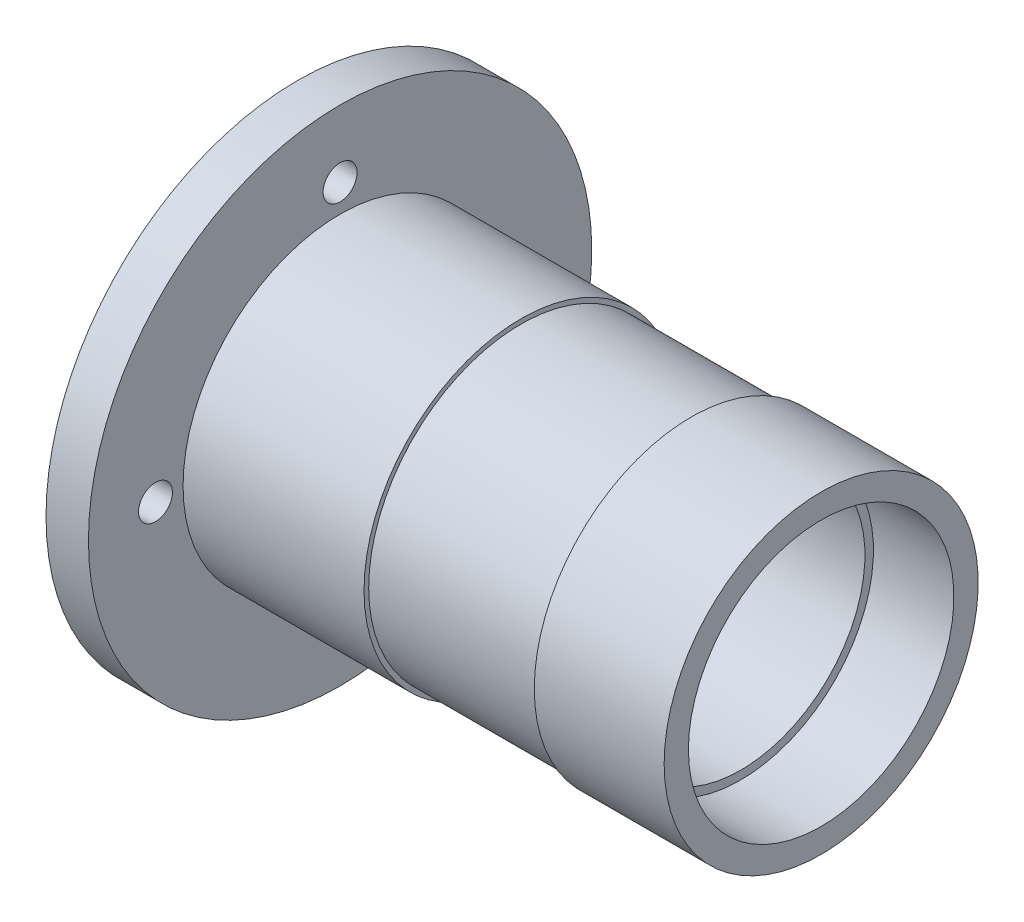
ISO-10303-21;
HEADER;
FILE_DESCRIPTION(('STEP AP214'),'2;1');
FILE_NAME('part.step','',(''),(''),'','','');
FILE_SCHEMA(('AUTOMOTIVE_DESIGN { 1 0 10303 214 1 1 1 1 }'));
ENDSEC;
DATA;
#1=APPLICATION_CONTEXT('core data for automotive mechanical design processes');
#2=APPLICATION_PROTOCOL_DEFINITION('international standard','automotive_design',2000,#1);
#3=PRODUCT_CONTEXT('',#1,'mechanical');
#4=PRODUCT('Part','Part','',(#3));
#5=PRODUCT_RELATED_PRODUCT_CATEGORY('part','',(#4));
#6=PRODUCT_DEFINITION_FORMATION('','',#4);
#7=PRODUCT_DEFINITION_CONTEXT('part definition',#1,'design');
#8=PRODUCT_DEFINITION('design','',#6,#7);
#9=PRODUCT_DEFINITION_SHAPE('','',#8);
#10=(LENGTH_UNIT() NAMED_UNIT(*) SI_UNIT(.MILLI.,.METRE.));
#11=(NAMED_UNIT(*) PLANE_ANGLE_UNIT() SI_UNIT($,.RADIAN.));
#12=(NAMED_UNIT(*) SI_UNIT($,.STERADIAN.) SOLID_ANGLE_UNIT());
#13=UNCERTAINTY_MEASURE_WITH_UNIT(LENGTH_MEASURE(1.E-05),#10,'distance_accuracy_value','');
#14=(GEOMETRIC_REPRESENTATION_CONTEXT(3) GLOBAL_UNCERTAINTY_ASSIGNED_CONTEXT((#13)) GLOBAL_UNIT_ASSIGNED_CONTEXT((#10,
#11,#12)) REPRESENTATION_CONTEXT('',''));
#15=CARTESIAN_POINT('',(0.,0.,0.));
#16=DIRECTION('',(0.,0.,1.));
#17=DIRECTION('',(1.,0.,0.));
#18=AXIS2_PLACEMENT_3D('',#15,#16,#17);
#19=CARTESIAN_POINT('',(73.2980507434922,31.28,0.));
#20=DIRECTION('',(-1.,0.,0.));
#21=DIRECTION('',(0.,0.,1.));
#22=AXIS2_PLACEMENT_3D('',#19,#20,#21);
#23=PLANE('',#22);
#24=CARTESIAN_POINT('',(73.2980507434922,0.,0.));
#25=DIRECTION('',(-1.,0.,0.));
#26=DIRECTION('',(0.,0.,1.));
#27=AXIS2_PLACEMENT_3D('',#24,#25,#26);
#28=CIRCLE('',#27,37.);
#29=CARTESIAN_POINT('',(73.2980507434922,0.,37.));
#30=VERTEX_POINT('',#29);
#31=EDGE_CURVE('E11',#30,#30,#28,.T.);
#32=ORIENTED_EDGE('',*,*,#31,.F.);
#33=EDGE_LOOP('',(#32));
#34=FACE_BOUND('',#33,.T.);
#35=CARTESIAN_POINT('',(73.2980507434922,0.,0.));
#36=DIRECTION('',(-1.,0.,0.));
#37=DIRECTION('',(0.,0.,1.));
#38=AXIS2_PLACEMENT_3D('',#35,#36,#37);
#39=CIRCLE('',#38,31.28);
#40=CARTESIAN_POINT('',(73.2980507434922,0.,31.28));
#41=VERTEX_POINT('',#40);
#42=EDGE_CURVE('E84',#41,#41,#39,.T.);
#43=ORIENTED_EDGE('',*,*,#42,.T.);
#44=EDGE_LOOP('',(#43));
#45=FACE_BOUND('',#44,.T.);
#46=ADVANCED_FACE('F38',(#34,#45),#23,.F.);
#47=CARTESIAN_POINT('',(-67.0431894929216,0.,0.));
#48=DIRECTION('',(-1.,0.,0.));
#49=DIRECTION('',(0.,0.,1.));
#50=AXIS2_PLACEMENT_3D('',#47,#48,#49);
#51=CYLINDRICAL_SURFACE('',#50,37.);
#52=CARTESIAN_POINT('',(42.6980507434922,0.,0.));
#53=DIRECTION('',(-1.,0.,0.));
#54=DIRECTION('',(0.,0.,1.));
#55=AXIS2_PLACEMENT_3D('',#52,#53,#54);
#56=CIRCLE('',#55,37.);
#57=CARTESIAN_POINT('',(42.6980507434922,0.,37.));
#58=VERTEX_POINT('',#57);
#59=EDGE_CURVE('E44',#58,#58,#56,.T.);
#60=ORIENTED_EDGE('',*,*,#59,.F.);
#61=EDGE_LOOP('',(#60));
#62=FACE_BOUND('',#61,.T.);
#63=ORIENTED_EDGE('',*,*,#31,.T.);
#64=EDGE_LOOP('',(#63));
#65=FACE_BOUND('',#64,.T.);
#66=ADVANCED_FACE('F163',(#62,#65),#51,.T.);
#67=CARTESIAN_POINT('',(42.6980507434922,37.,0.));
#68=DIRECTION('',(1.,0.,0.));
#69=DIRECTION('',(0.,0.,-1.));
#70=AXIS2_PLACEMENT_3D('',#67,#68,#69);
#71=PLANE('',#70);
#72=CARTESIAN_POINT('',(42.6980507434922,0.,0.));
#73=DIRECTION('',(-1.,0.,0.));
#74=DIRECTION('',(0.,0.,1.));
#75=AXIS2_PLACEMENT_3D('',#72,#73,#74);
#76=CIRCLE('',#75,35.9);
#77=CARTESIAN_POINT('',(42.6980507434922,0.,35.9));
#78=VERTEX_POINT('',#77);
#79=EDGE_CURVE('E48',#78,#78,#76,.T.);
#80=ORIENTED_EDGE('',*,*,#79,.F.);
#81=EDGE_LOOP('',(#80));
#82=FACE_BOUND('',#81,.T.);
#83=ORIENTED_EDGE('',*,*,#59,.T.);
#84=EDGE_LOOP('',(#83));
#85=FACE_BOUND('',#84,.T.);
#86=ADVANCED_FACE('F158',(#82,#85),#71,.F.);
#87=CARTESIAN_POINT('',(-67.0431894929216,0.,0.));
#88=DIRECTION('',(-1.,0.,0.));
#89=DIRECTION('',(0.,0.,1.));
#90=AXIS2_PLACEMENT_3D('',#87,#88,#89);
#91=CYLINDRICAL_SURFACE('',#90,35.9);
#92=CARTESIAN_POINT('',(2.57805074349222,0.,0.));
#93=DIRECTION('',(-1.,0.,0.));
#94=DIRECTION('',(0.,0.,1.));
#95=AXIS2_PLACEMENT_3D('',#92,#93,#94);
#96=CIRCLE('',#95,35.9);
#97=CARTESIAN_POINT('',(2.57805074349222,0.,35.9));
#98=VERTEX_POINT('',#97);
#99=EDGE_CURVE('E52',#98,#98,#96,.T.);
#100=ORIENTED_EDGE('',*,*,#99,.F.);
#101=EDGE_LOOP('',(#100));
#102=FACE_BOUND('',#101,.T.);
#103=ORIENTED_EDGE('',*,*,#79,.T.);
#104=EDGE_LOOP('',(#103));
#105=FACE_BOUND('',#104,.T.);
#106=ADVANCED_FACE('F152',(#102,#105),#91,.T.);
#107=CARTESIAN_POINT('',(2.57805074349223,35.9,0.));
#108=DIRECTION('',(-1.,0.,0.));
#109=DIRECTION('',(0.,0.,1.));
#110=AXIS2_PLACEMENT_3D('',#107,#108,#109);
#111=PLANE('',#110);
#112=CARTESIAN_POINT('',(2.57805074349222,0.,0.));
#113=DIRECTION('',(-1.,0.,0.));
#114=DIRECTION('',(0.,0.,1.));
#115=AXIS2_PLACEMENT_3D('',#112,#113,#114);
#116=CIRCLE('',#115,37.);
#117=CARTESIAN_POINT('',(2.57805074349222,0.,37.));
#118=VERTEX_POINT('',#117);
#119=EDGE_CURVE('E57',#118,#118,#116,.T.);
#120=ORIENTED_EDGE('',*,*,#119,.F.);
#121=EDGE_LOOP('',(#120));
#122=FACE_BOUND('',#121,.T.);
#123=ORIENTED_EDGE('',*,*,#99,.T.);
#124=EDGE_LOOP('',(#123));
#125=FACE_BOUND('',#124,.T.);
#126=ADVANCED_FACE('F146',(#122,#125),#111,.F.);
#127=CARTESIAN_POINT('',(-67.0431894929216,0.,0.));
#128=DIRECTION('',(-1.,0.,0.));
#129=DIRECTION('',(0.,0.,1.));
#130=AXIS2_PLACEMENT_3D('',#127,#128,#129);
#131=CYLINDRICAL_SURFACE('',#130,37.);
#132=CARTESIAN_POINT('',(-40.0619492565078,0.,0.));
#133=DIRECTION('',(-1.,0.,0.));
#134=DIRECTION('',(0.,0.,1.));
#135=AXIS2_PLACEMENT_3D('',#132,#133,#134);
#136=CIRCLE('',#135,37.);
#137=CARTESIAN_POINT('',(-40.0619492565078,0.,37.));
#138=VERTEX_POINT('',#137);
#139=EDGE_CURVE('E60',#138,#138,#136,.T.);
#140=ORIENTED_EDGE('',*,*,#139,.F.);
#141=EDGE_LOOP('',(#140));
#142=FACE_BOUND('',#141,.T.);
#143=ORIENTED_EDGE('',*,*,#119,.T.);
#144=EDGE_LOOP('',(#143));
#145=FACE_BOUND('',#144,.T.);
#146=ADVANCED_FACE('F139',(#142,#145),#131,.T.);
#147=CARTESIAN_POINT('',(-40.0619492565078,37.,0.));
#148=DIRECTION('',(-1.,0.,0.));
#149=DIRECTION('',(0.,0.,1.));
#150=AXIS2_PLACEMENT_3D('',#147,#148,#149);
#151=PLANE('',#150);
#152=CARTESIAN_POINT('',(-40.0619492565078,-6.07518016864451E-13,-43.4999999999994));
#153=DIRECTION('',(-1.,0.,0.));
#154=DIRECTION('',(0.,0.,1.));
#155=AXIS2_PLACEMENT_3D('',#152,#153,#154);
#156=CIRCLE('',#155,4.0000000000012);
#157=CARTESIAN_POINT('',(-40.0619492565078,-6.07518016864451E-13,-39.4999999999982));
#158=VERTEX_POINT('',#157);
#159=EDGE_CURVE('E105',#158,#158,#156,.T.);
#160=ORIENTED_EDGE('',*,*,#159,.T.);
#161=EDGE_LOOP('',(#160));
#162=FACE_BOUND('',#161,.T.);
#163=CARTESIAN_POINT('',(-40.0619492565078,-1.51879526208258E-13,43.5));
#164=DIRECTION('',(-1.,0.,0.));
#165=DIRECTION('',(0.,0.,1.));
#166=AXIS2_PLACEMENT_3D('',#163,#164,#165);
#167=CIRCLE('',#166,4.);
#168=CARTESIAN_POINT('',(-40.0619492565078,-1.51879526208258E-13,47.5));
#169=VERTEX_POINT('',#168);
#170=EDGE_CURVE('E99',#169,#169,#167,.T.);
#171=ORIENTED_EDGE('',*,*,#170,.T.);
#172=EDGE_LOOP('',(#171));
#173=FACE_BOUND('',#172,.T.);
#174=CARTESIAN_POINT('',(-40.0619492565078,-43.5,1.22569046088148E-12));
#175=DIRECTION('',(-1.,0.,0.));
#176=DIRECTION('',(0.,0.,1.));
#177=AXIS2_PLACEMENT_3D('',#174,#175,#176);
#178=CIRCLE('',#177,4.00000000000146);
#179=CARTESIAN_POINT('',(-40.0619492565078,-43.5,4.00000000000269));
#180=VERTEX_POINT('',#179);
#181=EDGE_CURVE('E93',#180,#180,#178,.T.);
#182=ORIENTED_EDGE('',*,*,#181,.T.);
#183=EDGE_LOOP('',(#182));
#184=FACE_BOUND('',#183,.T.);
#185=CARTESIAN_POINT('',(-40.0619492565078,43.5,0.));
#186=DIRECTION('',(-1.,0.,0.));
#187=DIRECTION('',(0.,0.,1.));
#188=AXIS2_PLACEMENT_3D('',#185,#186,#187);
#189=CIRCLE('',#188,4.);
#190=CARTESIAN_POINT('',(-40.0619492565078,43.5,4.));
#191=VERTEX_POINT('',#190);
#192=EDGE_CURVE('E87',#191,#191,#189,.T.);
#193=ORIENTED_EDGE('',*,*,#192,.T.);
#194=EDGE_LOOP('',(#193));
#195=FACE_BOUND('',#194,.T.);
#196=CARTESIAN_POINT('',(-40.0619492565078,0.,0.));
#197=DIRECTION('',(-1.,0.,0.));
#198=DIRECTION('',(0.,0.,1.));
#199=AXIS2_PLACEMENT_3D('',#196,#197,#198);
#200=CIRCLE('',#199,59.300299500832);
#201=CARTESIAN_POINT('',(-40.0619492565078,0.,59.300299500832));
#202=VERTEX_POINT('',#201);
#203=EDGE_CURVE('E63',#202,#202,#200,.T.);
#204=ORIENTED_EDGE('',*,*,#203,.F.);
#205=EDGE_LOOP('',(#204));
#206=FACE_BOUND('',#205,.T.);
#207=ORIENTED_EDGE('',*,*,#139,.T.);
#208=EDGE_LOOP('',(#207));
#209=FACE_BOUND('',#208,.T.);
#210=ADVANCED_FACE('F133',(#162,#173,#184,#195,#206,#209),#151,.F.);
#211=CARTESIAN_POINT('',(-67.0431894929216,0.,0.));
#212=DIRECTION('',(-1.,0.,0.));
#213=DIRECTION('',(0.,0.,1.));
#214=AXIS2_PLACEMENT_3D('',#211,#212,#213);
#215=CYLINDRICAL_SURFACE('',#214,59.300299500832);
#216=CARTESIAN_POINT('',(-50.0619492565078,0.,0.));
#217=DIRECTION('',(-1.,0.,0.));
#218=DIRECTION('',(0.,0.,1.));
#219=AXIS2_PLACEMENT_3D('',#216,#217,#218);
#220=CIRCLE('',#219,59.300299500832);
#221=CARTESIAN_POINT('',(-50.0619492565078,0.,59.300299500832));
#222=VERTEX_POINT('',#221);
#223=EDGE_CURVE('E66',#222,#222,#220,.T.);
#224=ORIENTED_EDGE('',*,*,#223,.F.);
#225=EDGE_LOOP('',(#224));
#226=FACE_BOUND('',#225,.T.);
#227=ORIENTED_EDGE('',*,*,#203,.T.);
#228=EDGE_LOOP('',(#227));
#229=FACE_BOUND('',#228,.T.);
#230=ADVANCED_FACE('F119',(#226,#229),#215,.T.);
#231=CARTESIAN_POINT('',(-50.0619492565078,59.300299500832,0.));
#232=DIRECTION('',(1.,0.,0.));
#233=DIRECTION('',(0.,0.,-1.));
#234=AXIS2_PLACEMENT_3D('',#231,#232,#233);
#235=PLANE('',#234);
#236=CARTESIAN_POINT('',(-50.0619492565078,-6.07518016864451E-13,-43.4999999999994));
#237=DIRECTION('',(-1.,0.,0.));
#238=DIRECTION('',(0.,0.,1.));
#239=AXIS2_PLACEMENT_3D('',#236,#237,#238);
#240=CIRCLE('',#239,4.0000000000012);
#241=CARTESIAN_POINT('',(-50.0619492565078,-6.07518016864451E-13,-39.4999999999982));
#242=VERTEX_POINT('',#241);
#243=EDGE_CURVE('E108',#242,#242,#240,.T.);
#244=ORIENTED_EDGE('',*,*,#243,.F.);
#245=EDGE_LOOP('',(#244));
#246=FACE_BOUND('',#245,.T.);
#247=CARTESIAN_POINT('',(-50.0619492565078,-1.51879526208258E-13,43.5));
#248=DIRECTION('',(-1.,0.,0.));
#249=DIRECTION('',(0.,0.,1.));
#250=AXIS2_PLACEMENT_3D('',#247,#248,#249);
#251=CIRCLE('',#250,4.);
#252=CARTESIAN_POINT('',(-50.0619492565078,-1.51879526208258E-13,47.5));
#253=VERTEX_POINT('',#252);
#254=EDGE_CURVE('E102',#253,#253,#251,.T.);
#255=ORIENTED_EDGE('',*,*,#254,.F.);
#256=EDGE_LOOP('',(#255));
#257=FACE_BOUND('',#256,.T.);
#258=CARTESIAN_POINT('',(-50.0619492565078,-43.5,1.22569046088148E-12));
#259=DIRECTION('',(-1.,0.,0.));
#260=DIRECTION('',(0.,0.,1.));
#261=AXIS2_PLACEMENT_3D('',#258,#259,#260);
#262=CIRCLE('',#261,4.00000000000146);
#263=CARTESIAN_POINT('',(-50.0619492565078,-43.5,4.00000000000269));
#264=VERTEX_POINT('',#263);
#265=EDGE_CURVE('E96',#264,#264,#262,.T.);
#266=ORIENTED_EDGE('',*,*,#265,.F.);
#267=EDGE_LOOP('',(#266));
#268=FACE_BOUND('',#267,.T.);
#269=CARTESIAN_POINT('',(-50.0619492565078,43.5,0.));
#270=DIRECTION('',(-1.,0.,0.));
#271=DIRECTION('',(0.,0.,1.));
#272=AXIS2_PLACEMENT_3D('',#269,#270,#271);
#273=CIRCLE('',#272,4.);
#274=CARTESIAN_POINT('',(-50.0619492565078,43.5,4.));
#275=VERTEX_POINT('',#274);
#276=EDGE_CURVE('E90',#275,#275,#273,.T.);
#277=ORIENTED_EDGE('',*,*,#276,.F.);
#278=EDGE_LOOP('',(#277));
#279=FACE_BOUND('',#278,.T.);
#280=CARTESIAN_POINT('',(-50.0619492565078,0.,0.));
#281=DIRECTION('',(-1.,0.,0.));
#282=DIRECTION('',(0.,0.,1.));
#283=AXIS2_PLACEMENT_3D('',#280,#281,#282);
#284=CIRCLE('',#283,31.28);
#285=CARTESIAN_POINT('',(-50.0619492565078,0.,31.28));
#286=VERTEX_POINT('',#285);
#287=EDGE_CURVE('E69',#286,#286,#284,.T.);
#288=ORIENTED_EDGE('',*,*,#287,.F.);
#289=EDGE_LOOP('',(#288));
#290=FACE_BOUND('',#289,.T.);
#291=ORIENTED_EDGE('',*,*,#223,.T.);
#292=EDGE_LOOP('',(#291));
#293=FACE_BOUND('',#292,.T.);
#294=ADVANCED_FACE('F115',(#246,#257,#268,#279,#290,#293),#235,.F.);
#295=CARTESIAN_POINT('',(-67.0431894929216,0.,0.));
#296=DIRECTION('',(-1.,0.,0.));
#297=DIRECTION('',(0.,0.,1.));
#298=AXIS2_PLACEMENT_3D('',#295,#296,#297);
#299=CYLINDRICAL_SURFACE('',#298,31.28);
#300=CARTESIAN_POINT('',(-9.06194925650777,0.,0.));
#301=DIRECTION('',(-1.,0.,0.));
#302=DIRECTION('',(0.,0.,1.));
#303=AXIS2_PLACEMENT_3D('',#300,#301,#302);
#304=CIRCLE('',#303,31.28);
#305=CARTESIAN_POINT('',(-9.06194925650777,0.,31.28));
#306=VERTEX_POINT('',#305);
#307=EDGE_CURVE('E72',#306,#306,#304,.T.);
#308=ORIENTED_EDGE('',*,*,#307,.F.);
#309=EDGE_LOOP('',(#308));
#310=FACE_BOUND('',#309,.T.);
#311=ORIENTED_EDGE('',*,*,#287,.T.);
#312=EDGE_LOOP('',(#311));
#313=FACE_BOUND('',#312,.T.);
#314=ADVANCED_FACE('F118',(#310,#313),#299,.F.);
#315=CARTESIAN_POINT('',(-9.06194925650777,31.28,0.));
#316=DIRECTION('',(1.,0.,0.));
#317=DIRECTION('',(0.,0.,-1.));
#318=AXIS2_PLACEMENT_3D('',#315,#316,#317);
#319=PLANE('',#318);
#320=CARTESIAN_POINT('',(-9.06194925650777,0.,0.));
#321=DIRECTION('',(-1.,0.,0.));
#322=DIRECTION('',(0.,0.,1.));
#323=AXIS2_PLACEMENT_3D('',#320,#321,#322);
#324=CIRCLE('',#323,29.28);
#325=CARTESIAN_POINT('',(-9.06194925650777,0.,29.28));
#326=VERTEX_POINT('',#325);
#327=EDGE_CURVE('E75',#326,#326,#324,.T.);
#328=ORIENTED_EDGE('',*,*,#327,.F.);
#329=EDGE_LOOP('',(#328));
#330=FACE_BOUND('',#329,.T.);
#331=ORIENTED_EDGE('',*,*,#307,.T.);
#332=EDGE_LOOP('',(#331));
#333=FACE_BOUND('',#332,.T.);
#334=ADVANCED_FACE('F192',(#330,#333),#319,.F.);
#335=CARTESIAN_POINT('',(-67.0431894929216,0.,0.));
#336=DIRECTION('',(-1.,0.,0.));
#337=DIRECTION('',(0.,0.,1.));
#338=AXIS2_PLACEMENT_3D('',#335,#336,#337);
#339=CYLINDRICAL_SURFACE('',#338,29.28);
#340=CARTESIAN_POINT('',(54.3380507434922,0.,0.));
#341=DIRECTION('',(-1.,0.,0.));
#342=DIRECTION('',(0.,0.,1.));
#343=AXIS2_PLACEMENT_3D('',#340,#341,#342);
#344=CIRCLE('',#343,29.28);
#345=CARTESIAN_POINT('',(54.3380507434922,0.,29.28));
#346=VERTEX_POINT('',#345);
#347=EDGE_CURVE('E78',#346,#346,#344,.T.);
#348=ORIENTED_EDGE('',*,*,#347,.F.);
#349=EDGE_LOOP('',(#348));
#350=FACE_BOUND('',#349,.T.);
#351=ORIENTED_EDGE('',*,*,#327,.T.);
#352=EDGE_LOOP('',(#351));
#353=FACE_BOUND('',#352,.T.);
#354=ADVANCED_FACE('F186',(#350,#353),#339,.F.);
#355=CARTESIAN_POINT('',(54.3380507434922,29.28,0.));
#356=DIRECTION('',(-1.,0.,0.));
#357=DIRECTION('',(0.,0.,1.));
#358=AXIS2_PLACEMENT_3D('',#355,#356,#357);
#359=PLANE('',#358);
#360=CARTESIAN_POINT('',(54.3380507434922,0.,0.));
#361=DIRECTION('',(-1.,0.,0.));
#362=DIRECTION('',(0.,0.,1.));
#363=AXIS2_PLACEMENT_3D('',#360,#361,#362);
#364=CIRCLE('',#363,31.28);
#365=CARTESIAN_POINT('',(54.3380507434922,0.,31.28));
#366=VERTEX_POINT('',#365);
#367=EDGE_CURVE('E81',#366,#366,#364,.T.);
#368=ORIENTED_EDGE('',*,*,#367,.F.);
#369=EDGE_LOOP('',(#368));
#370=FACE_BOUND('',#369,.T.);
#371=ORIENTED_EDGE('',*,*,#347,.T.);
#372=EDGE_LOOP('',(#371));
#373=FACE_BOUND('',#372,.T.);
#374=ADVANCED_FACE('F180',(#370,#373),#359,.F.);
#375=CARTESIAN_POINT('',(-67.0431894929216,0.,0.));
#376=DIRECTION('',(-1.,0.,0.));
#377=DIRECTION('',(0.,0.,1.));
#378=AXIS2_PLACEMENT_3D('',#375,#376,#377);
#379=CYLINDRICAL_SURFACE('',#378,31.28);
#380=ORIENTED_EDGE('',*,*,#42,.F.);
#381=EDGE_LOOP('',(#380));
#382=FACE_BOUND('',#381,.T.);
#383=ORIENTED_EDGE('',*,*,#367,.T.);
#384=EDGE_LOOP('',(#383));
#385=FACE_BOUND('',#384,.T.);
#386=ADVANCED_FACE('F176',(#382,#385),#379,.F.);
#387=CARTESIAN_POINT('',(73.2980507434922,43.5,0.));
#388=DIRECTION('',(-1.,0.,0.));
#389=DIRECTION('',(0.,0.,1.));
#390=AXIS2_PLACEMENT_3D('',#387,#388,#389);
#391=CYLINDRICAL_SURFACE('',#390,4.);
#392=ORIENTED_EDGE('',*,*,#276,.T.);
#393=EDGE_LOOP('',(#392));
#394=FACE_BOUND('',#393,.T.);
#395=ORIENTED_EDGE('',*,*,#192,.F.);
#396=EDGE_LOOP('',(#395));
#397=FACE_BOUND('',#396,.T.);
#398=ADVANCED_FACE('F179',(#394,#397),#391,.F.);
#399=CARTESIAN_POINT('',(73.2980507434922,-43.5,1.22569046088148E-12));
#400=DIRECTION('',(-1.,0.,0.));
#401=DIRECTION('',(0.,0.,1.));
#402=AXIS2_PLACEMENT_3D('',#399,#400,#401);
#403=CYLINDRICAL_SURFACE('',#402,4.00000000000146);
#404=ORIENTED_EDGE('',*,*,#265,.T.);
#405=EDGE_LOOP('',(#404));
#406=FACE_BOUND('',#405,.T.);
#407=ORIENTED_EDGE('',*,*,#181,.F.);
#408=EDGE_LOOP('',(#407));
#409=FACE_BOUND('',#408,.T.);
#410=ADVANCED_FACE('F210',(#406,#409),#403,.F.);
#411=CARTESIAN_POINT('',(73.2980507434922,-1.51879526208258E-13,43.5));
#412=DIRECTION('',(-1.,0.,0.));
#413=DIRECTION('',(0.,0.,1.));
#414=AXIS2_PLACEMENT_3D('',#411,#412,#413);
#415=CYLINDRICAL_SURFACE('',#414,4.);
#416=ORIENTED_EDGE('',*,*,#254,.T.);
#417=EDGE_LOOP('',(#416));
#418=FACE_BOUND('',#417,.T.);
#419=ORIENTED_EDGE('',*,*,#170,.F.);
#420=EDGE_LOOP('',(#419));
#421=FACE_BOUND('',#420,.T.);
#422=ADVANCED_FACE('F214',(#418,#421),#415,.F.);
#423=CARTESIAN_POINT('',(73.2980507434922,-6.07518016864451E-13,-43.4999999999994));
#424=DIRECTION('',(-1.,0.,0.));
#425=DIRECTION('',(0.,0.,1.));
#426=AXIS2_PLACEMENT_3D('',#423,#424,#425);
#427=CYLINDRICAL_SURFACE('',#426,4.0000000000012);
#428=ORIENTED_EDGE('',*,*,#243,.T.);
#429=EDGE_LOOP('',(#428));
#430=FACE_BOUND('',#429,.T.);
#431=ORIENTED_EDGE('',*,*,#159,.F.);
#432=EDGE_LOOP('',(#431));
#433=FACE_BOUND('',#432,.T.);
#434=ADVANCED_FACE('F112',(#430,#433),#427,.F.);
#435=CLOSED_SHELL('',(#46,#66,#86,#106,#126,#146,#210,#230,#294,#314,#334,#354,#374,#386,#398,
#410,#422,#434));
#436=MANIFOLD_SOLID_BREP('B2',#435);
#437=ADVANCED_BREP_SHAPE_REPRESENTATION('',(#18,#436),#14);
#438=SHAPE_DEFINITION_REPRESENTATION(#9,#437);
ENDSEC;
END-ISO-10303-21;
